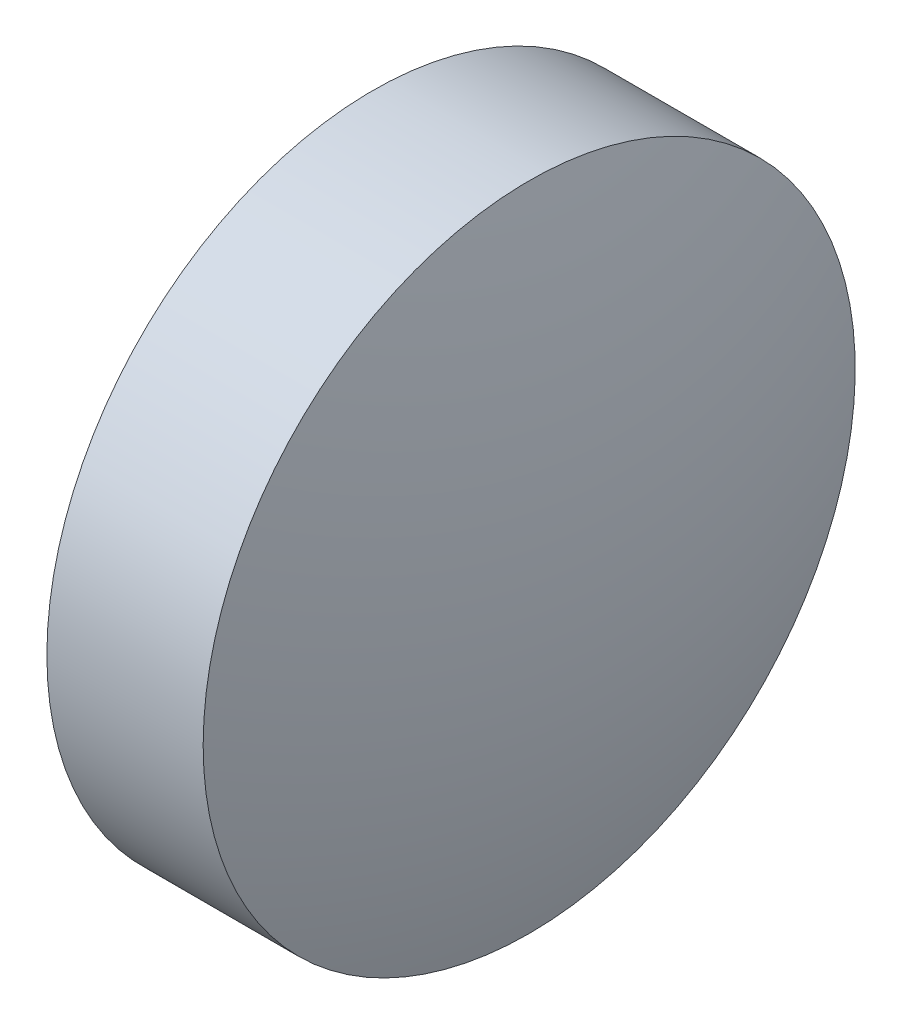
ISO-10303-21;
HEADER;
FILE_DESCRIPTION(('STEP AP214'),'2;1');
FILE_NAME('part.step','',(''),(''),'','','');
FILE_SCHEMA(('AUTOMOTIVE_DESIGN { 1 0 10303 214 1 1 1 1 }'));
ENDSEC;
DATA;
#1=APPLICATION_CONTEXT('core data for automotive mechanical design processes');
#2=APPLICATION_PROTOCOL_DEFINITION('international standard','automotive_design',2000,#1);
#3=PRODUCT_CONTEXT('',#1,'mechanical');
#4=PRODUCT('Part','Part','',(#3));
#5=PRODUCT_RELATED_PRODUCT_CATEGORY('part','',(#4));
#6=PRODUCT_DEFINITION_FORMATION('','',#4);
#7=PRODUCT_DEFINITION_CONTEXT('part definition',#1,'design');
#8=PRODUCT_DEFINITION('design','',#6,#7);
#9=PRODUCT_DEFINITION_SHAPE('','',#8);
#10=(LENGTH_UNIT() NAMED_UNIT(*) SI_UNIT(.MILLI.,.METRE.));
#11=(NAMED_UNIT(*) PLANE_ANGLE_UNIT() SI_UNIT($,.RADIAN.));
#12=(NAMED_UNIT(*) SI_UNIT($,.STERADIAN.) SOLID_ANGLE_UNIT());
#13=UNCERTAINTY_MEASURE_WITH_UNIT(LENGTH_MEASURE(1.E-05),#10,'distance_accuracy_value','');
#14=(GEOMETRIC_REPRESENTATION_CONTEXT(3) GLOBAL_UNCERTAINTY_ASSIGNED_CONTEXT((#13)) GLOBAL_UNIT_ASSIGNED_CONTEXT((#10,
#11,#12)) REPRESENTATION_CONTEXT('',''));
#15=CARTESIAN_POINT('',(0.,0.,0.));
#16=DIRECTION('',(0.,0.,1.));
#17=DIRECTION('',(1.,0.,0.));
#18=AXIS2_PLACEMENT_3D('',#15,#16,#17);
#19=CARTESIAN_POINT('',(555.983466831551,45.4646320052683,0.));
#20=DIRECTION('',(-1.,0.,0.));
#21=DIRECTION('',(0.,-1.,0.));
#22=AXIS2_PLACEMENT_3D('',#19,#20,#21);
#23=SPHERICAL_SURFACE('',#22,10.3699999999999);
#24=CARTESIAN_POINT('',(565.863466831551,45.4646320052683,0.));
#25=DIRECTION('',(-1.,0.,0.));
#26=DIRECTION('',(0.,0.,1.));
#27=AXIS2_PLACEMENT_3D('',#24,#25,#26);
#28=CIRCLE('',#27,3.15);
#29=CARTESIAN_POINT('',(565.863466831551,45.4646320052683,3.15));
#30=VERTEX_POINT('',#29);
#31=EDGE_CURVE('E10',#30,#30,#28,.T.);
#32=ORIENTED_EDGE('',*,*,#31,.F.);
#33=EDGE_LOOP('',(#32));
#34=FACE_BOUND('',#33,.T.);
#35=ADVANCED_FACE('F35',(#34),#23,.T.);
#36=CARTESIAN_POINT('',(563.491838661966,45.4646320052683,0.));
#37=DIRECTION('',(-1.,0.,0.));
#38=DIRECTION('',(0.,0.,1.));
#39=AXIS2_PLACEMENT_3D('',#36,#37,#38);
#40=CYLINDRICAL_SURFACE('',#39,3.15);
#41=CARTESIAN_POINT('',(564.353466831551,45.4646320052683,0.));
#42=DIRECTION('',(-1.,0.,0.));
#43=DIRECTION('',(0.,0.,1.));
#44=AXIS2_PLACEMENT_3D('',#41,#42,#43);
#45=CIRCLE('',#44,3.15);
#46=CARTESIAN_POINT('',(564.353466831551,45.4646320052683,3.15));
#47=VERTEX_POINT('',#46);
#48=EDGE_CURVE('E41',#47,#47,#45,.T.);
#49=ORIENTED_EDGE('',*,*,#48,.F.);
#50=EDGE_LOOP('',(#49));
#51=FACE_BOUND('',#50,.T.);
#52=ORIENTED_EDGE('',*,*,#31,.T.);
#53=EDGE_LOOP('',(#52));
#54=FACE_BOUND('',#53,.T.);
#55=ADVANCED_FACE('F49',(#51,#54),#40,.T.);
#56=CARTESIAN_POINT('',(564.353466831551,45.4646320052683,0.));
#57=DIRECTION('',(1.,0.,0.));
#58=DIRECTION('',(0.,0.,-1.));
#59=AXIS2_PLACEMENT_3D('',#56,#57,#58);
#60=PLANE('',#59);
#61=ORIENTED_EDGE('',*,*,#48,.T.);
#62=EDGE_LOOP('',(#61));
#63=FACE_BOUND('',#62,.T.);
#64=ADVANCED_FACE('F47',(#63),#60,.F.);
#65=CLOSED_SHELL('',(#35,#55,#64));
#66=MANIFOLD_SOLID_BREP('B2',#65);
#67=ADVANCED_BREP_SHAPE_REPRESENTATION('',(#18,#66),#14);
#68=SHAPE_DEFINITION_REPRESENTATION(#9,#67);
ENDSEC;
END-ISO-10303-21;
